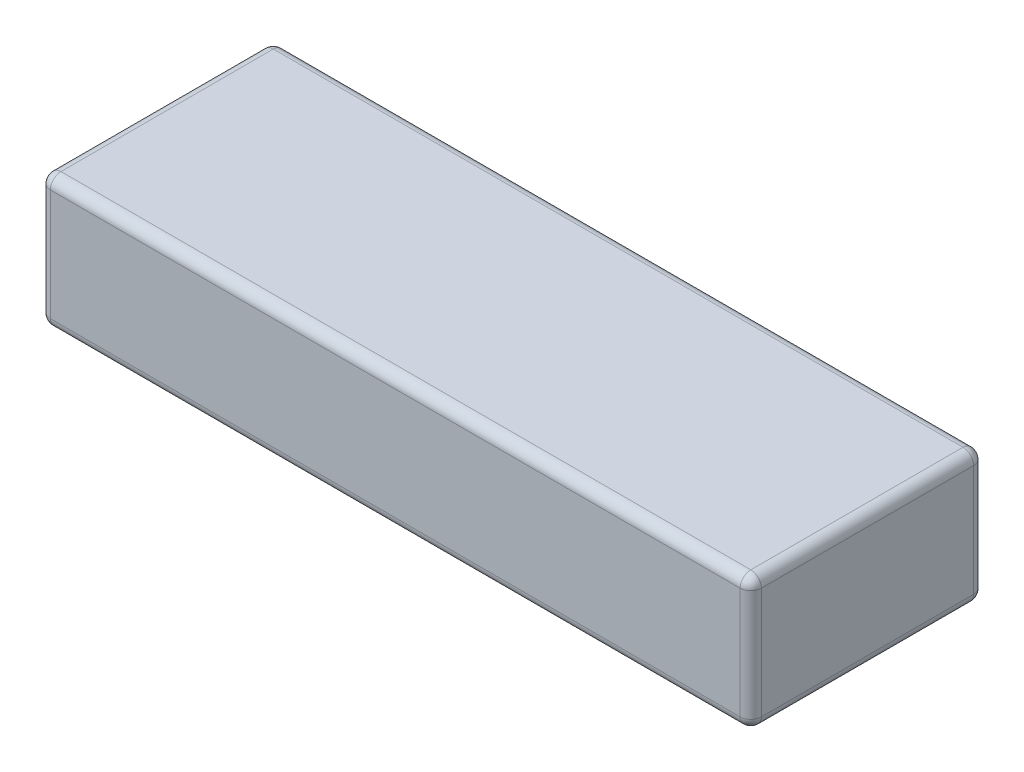
ISO-10303-21;
HEADER;
FILE_DESCRIPTION(('STEP AP214'),'2;1');
FILE_NAME('part.step','',(''),(''),'','','');
FILE_SCHEMA(('AUTOMOTIVE_DESIGN { 1 0 10303 214 1 1 1 1 }'));
ENDSEC;
DATA;
#1=APPLICATION_CONTEXT('core data for automotive mechanical design processes');
#2=APPLICATION_PROTOCOL_DEFINITION('international standard','automotive_design',2000,#1);
#3=PRODUCT_CONTEXT('',#1,'mechanical');
#4=PRODUCT('Part','Part','',(#3));
#5=PRODUCT_RELATED_PRODUCT_CATEGORY('part','',(#4));
#6=PRODUCT_DEFINITION_FORMATION('','',#4);
#7=PRODUCT_DEFINITION_CONTEXT('part definition',#1,'design');
#8=PRODUCT_DEFINITION('design','',#6,#7);
#9=PRODUCT_DEFINITION_SHAPE('','',#8);
#10=(LENGTH_UNIT() NAMED_UNIT(*) SI_UNIT(.MILLI.,.METRE.));
#11=(NAMED_UNIT(*) PLANE_ANGLE_UNIT() SI_UNIT($,.RADIAN.));
#12=(NAMED_UNIT(*) SI_UNIT($,.STERADIAN.) SOLID_ANGLE_UNIT());
#13=UNCERTAINTY_MEASURE_WITH_UNIT(LENGTH_MEASURE(1.E-05),#10,'distance_accuracy_value','');
#14=(GEOMETRIC_REPRESENTATION_CONTEXT(3) GLOBAL_UNCERTAINTY_ASSIGNED_CONTEXT((#13)) GLOBAL_UNIT_ASSIGNED_CONTEXT((#10,
#11,#12)) REPRESENTATION_CONTEXT('',''));
#15=CARTESIAN_POINT('',(0.,0.,0.));
#16=DIRECTION('',(0.,0.,1.));
#17=DIRECTION('',(1.,0.,0.));
#18=AXIS2_PLACEMENT_3D('',#15,#16,#17);
#19=CARTESIAN_POINT('',(67.,25.,22.));
#20=DIRECTION('',(-1.,0.,0.));
#21=DIRECTION('',(0.,0.,1.));
#22=AXIS2_PLACEMENT_3D('',#19,#20,#21);
#23=PLANE('',#22);
#24=DIRECTION('',(0.,-1.,0.));
#25=VECTOR('',#24,1.);
#26=CARTESIAN_POINT('',(67.,25.,-20.));
#27=LINE('',#26,#25);
#28=CARTESIAN_POINT('',(67.,2.,-20.));
#29=VERTEX_POINT('',#28);
#30=CARTESIAN_POINT('',(67.,23.,-20.));
#31=VERTEX_POINT('',#30);
#32=EDGE_CURVE('E128',#29,#31,#27,.F.);
#33=ORIENTED_EDGE('',*,*,#32,.T.);
#34=DIRECTION('',(0.,0.,-1.));
#35=VECTOR('',#34,1.);
#36=CARTESIAN_POINT('',(67.,23.,22.));
#37=LINE('',#36,#35);
#38=CARTESIAN_POINT('',(67.,23.,20.));
#39=VERTEX_POINT('',#38);
#40=EDGE_CURVE('E165',#31,#39,#37,.F.);
#41=ORIENTED_EDGE('',*,*,#40,.T.);
#42=DIRECTION('',(0.,-1.,0.));
#43=VECTOR('',#42,1.);
#44=CARTESIAN_POINT('',(67.,25.,20.));
#45=LINE('',#44,#43);
#46=CARTESIAN_POINT('',(67.,2.,20.));
#47=VERTEX_POINT('',#46);
#48=EDGE_CURVE('E162',#39,#47,#45,.T.);
#49=ORIENTED_EDGE('',*,*,#48,.T.);
#50=DIRECTION('',(0.,0.,-1.));
#51=VECTOR('',#50,1.);
#52=CARTESIAN_POINT('',(67.,2.,-22.));
#53=LINE('',#52,#51);
#54=EDGE_CURVE('E157',#47,#29,#53,.T.);
#55=ORIENTED_EDGE('',*,*,#54,.T.);
#56=EDGE_LOOP('',(#33,#41,#49,#55));
#57=FACE_BOUND('',#56,.T.);
#58=ADVANCED_FACE('F33',(#57),#23,.F.);
#59=CARTESIAN_POINT('',(-67.,25.,-22.));
#60=DIRECTION('',(0.,0.,1.));
#61=DIRECTION('',(1.,0.,0.));
#62=AXIS2_PLACEMENT_3D('',#59,#60,#61);
#63=PLANE('',#62);
#64=DIRECTION('',(0.,-1.,0.));
#65=VECTOR('',#64,1.);
#66=CARTESIAN_POINT('',(-65.,25.,-22.));
#67=LINE('',#66,#65);
#68=CARTESIAN_POINT('',(-65.,2.,-22.));
#69=VERTEX_POINT('',#68);
#70=CARTESIAN_POINT('',(-65.,23.,-22.));
#71=VERTEX_POINT('',#70);
#72=EDGE_CURVE('E150',#69,#71,#67,.F.);
#73=ORIENTED_EDGE('',*,*,#72,.T.);
#74=DIRECTION('',(-1.,0.,0.));
#75=VECTOR('',#74,1.);
#76=CARTESIAN_POINT('',(-67.,23.,-22.));
#77=LINE('',#76,#75);
#78=CARTESIAN_POINT('',(65.,23.,-22.));
#79=VERTEX_POINT('',#78);
#80=EDGE_CURVE('E154',#71,#79,#77,.F.);
#81=ORIENTED_EDGE('',*,*,#80,.T.);
#82=DIRECTION('',(0.,-1.,0.));
#83=VECTOR('',#82,1.);
#84=CARTESIAN_POINT('',(65.,25.,-22.));
#85=LINE('',#84,#83);
#86=CARTESIAN_POINT('',(65.,2.,-22.));
#87=VERTEX_POINT('',#86);
#88=EDGE_CURVE('E126',#79,#87,#85,.T.);
#89=ORIENTED_EDGE('',*,*,#88,.T.);
#90=DIRECTION('',(-1.,0.,0.));
#91=VECTOR('',#90,1.);
#92=CARTESIAN_POINT('',(-67.,2.,-22.));
#93=LINE('',#92,#91);
#94=EDGE_CURVE('E144',#87,#69,#93,.T.);
#95=ORIENTED_EDGE('',*,*,#94,.T.);
#96=EDGE_LOOP('',(#73,#81,#89,#95));
#97=FACE_BOUND('',#96,.T.);
#98=ADVANCED_FACE('F152',(#97),#63,.F.);
#99=CARTESIAN_POINT('',(-67.,25.,22.));
#100=DIRECTION('',(1.,0.,0.));
#101=DIRECTION('',(0.,0.,-1.));
#102=AXIS2_PLACEMENT_3D('',#99,#100,#101);
#103=PLANE('',#102);
#104=DIRECTION('',(0.,-1.,0.));
#105=VECTOR('',#104,1.);
#106=CARTESIAN_POINT('',(-67.,25.,20.));
#107=LINE('',#106,#105);
#108=CARTESIAN_POINT('',(-67.,2.,20.));
#109=VERTEX_POINT('',#108);
#110=CARTESIAN_POINT('',(-67.,23.,20.));
#111=VERTEX_POINT('',#110);
#112=EDGE_CURVE('E169',#109,#111,#107,.F.);
#113=ORIENTED_EDGE('',*,*,#112,.T.);
#114=DIRECTION('',(0.,0.,1.));
#115=VECTOR('',#114,1.);
#116=CARTESIAN_POINT('',(-67.,23.,22.));
#117=LINE('',#116,#115);
#118=CARTESIAN_POINT('',(-67.,23.,-20.));
#119=VERTEX_POINT('',#118);
#120=EDGE_CURVE('E174',#111,#119,#117,.F.);
#121=ORIENTED_EDGE('',*,*,#120,.T.);
#122=DIRECTION('',(0.,-1.,0.));
#123=VECTOR('',#122,1.);
#124=CARTESIAN_POINT('',(-67.,25.,-20.));
#125=LINE('',#124,#123);
#126=CARTESIAN_POINT('',(-67.,2.,-20.));
#127=VERTEX_POINT('',#126);
#128=EDGE_CURVE('E171',#119,#127,#125,.T.);
#129=ORIENTED_EDGE('',*,*,#128,.T.);
#130=DIRECTION('',(0.,0.,1.));
#131=VECTOR('',#130,1.);
#132=CARTESIAN_POINT('',(-67.,2.,22.));
#133=LINE('',#132,#131);
#134=EDGE_CURVE('E167',#127,#109,#133,.T.);
#135=ORIENTED_EDGE('',*,*,#134,.T.);
#136=EDGE_LOOP('',(#113,#121,#129,#135));
#137=FACE_BOUND('',#136,.T.);
#138=ADVANCED_FACE('F279',(#137),#103,.F.);
#139=CARTESIAN_POINT('',(-67.,25.,22.));
#140=DIRECTION('',(0.,0.,-1.));
#141=DIRECTION('',(-1.,0.,0.));
#142=AXIS2_PLACEMENT_3D('',#139,#140,#141);
#143=PLANE('',#142);
#144=DIRECTION('',(0.,-1.,0.));
#145=VECTOR('',#144,1.);
#146=CARTESIAN_POINT('',(65.,25.,22.));
#147=LINE('',#146,#145);
#148=CARTESIAN_POINT('',(65.,2.,22.));
#149=VERTEX_POINT('',#148);
#150=CARTESIAN_POINT('',(65.,23.,22.));
#151=VERTEX_POINT('',#150);
#152=EDGE_CURVE('E178',#149,#151,#147,.F.);
#153=ORIENTED_EDGE('',*,*,#152,.T.);
#154=DIRECTION('',(1.,0.,0.));
#155=VECTOR('',#154,1.);
#156=CARTESIAN_POINT('',(-67.,23.,22.));
#157=LINE('',#156,#155);
#158=CARTESIAN_POINT('',(-65.,23.,22.));
#159=VERTEX_POINT('',#158);
#160=EDGE_CURVE('E183',#151,#159,#157,.F.);
#161=ORIENTED_EDGE('',*,*,#160,.T.);
#162=DIRECTION('',(0.,-1.,0.));
#163=VECTOR('',#162,1.);
#164=CARTESIAN_POINT('',(-65.,25.,22.));
#165=LINE('',#164,#163);
#166=CARTESIAN_POINT('',(-65.,2.,22.));
#167=VERTEX_POINT('',#166);
#168=EDGE_CURVE('E180',#159,#167,#165,.T.);
#169=ORIENTED_EDGE('',*,*,#168,.T.);
#170=DIRECTION('',(1.,0.,0.));
#171=VECTOR('',#170,1.);
#172=CARTESIAN_POINT('',(67.,2.,22.));
#173=LINE('',#172,#171);
#174=EDGE_CURVE('E176',#167,#149,#173,.T.);
#175=ORIENTED_EDGE('',*,*,#174,.T.);
#176=EDGE_LOOP('',(#153,#161,#169,#175));
#177=FACE_BOUND('',#176,.T.);
#178=ADVANCED_FACE('F289',(#177),#143,.F.);
#179=CARTESIAN_POINT('',(0.,25.,0.));
#180=DIRECTION('',(0.,-1.,0.));
#181=DIRECTION('',(0.,0.,-1.));
#182=AXIS2_PLACEMENT_3D('',#179,#180,#181);
#183=PLANE('',#182);
#184=DIRECTION('',(0.,0.,1.));
#185=VECTOR('',#184,1.);
#186=CARTESIAN_POINT('',(-65.,25.,0.));
#187=LINE('',#186,#185);
#188=CARTESIAN_POINT('',(-65.,25.,-20.));
#189=VERTEX_POINT('',#188);
#190=CARTESIAN_POINT('',(-65.,25.,20.));
#191=VERTEX_POINT('',#190);
#192=EDGE_CURVE('E189',#189,#191,#187,.T.);
#193=ORIENTED_EDGE('',*,*,#192,.T.);
#194=DIRECTION('',(1.,0.,0.));
#195=VECTOR('',#194,1.);
#196=CARTESIAN_POINT('',(0.,25.,20.));
#197=LINE('',#196,#195);
#198=CARTESIAN_POINT('',(65.,25.,20.));
#199=VERTEX_POINT('',#198);
#200=EDGE_CURVE('E191',#191,#199,#197,.T.);
#201=ORIENTED_EDGE('',*,*,#200,.T.);
#202=DIRECTION('',(0.,0.,-1.));
#203=VECTOR('',#202,1.);
#204=CARTESIAN_POINT('',(65.,25.,0.));
#205=LINE('',#204,#203);
#206=CARTESIAN_POINT('',(65.,25.,-20.));
#207=VERTEX_POINT('',#206);
#208=EDGE_CURVE('E185',#199,#207,#205,.T.);
#209=ORIENTED_EDGE('',*,*,#208,.T.);
#210=DIRECTION('',(-1.,0.,0.));
#211=VECTOR('',#210,1.);
#212=CARTESIAN_POINT('',(0.,25.,-20.));
#213=LINE('',#212,#211);
#214=EDGE_CURVE('E187',#207,#189,#213,.T.);
#215=ORIENTED_EDGE('',*,*,#214,.T.);
#216=EDGE_LOOP('',(#193,#201,#209,#215));
#217=FACE_BOUND('',#216,.T.);
#218=ADVANCED_FACE('F271',(#217),#183,.F.);
#219=CARTESIAN_POINT('',(0.,0.,0.));
#220=DIRECTION('',(0.,-1.,0.));
#221=DIRECTION('',(0.,0.,-1.));
#222=AXIS2_PLACEMENT_3D('',#219,#220,#221);
#223=PLANE('',#222);
#224=DIRECTION('',(0.,0.,-1.));
#225=VECTOR('',#224,1.);
#226=CARTESIAN_POINT('',(65.,0.,22.));
#227=LINE('',#226,#225);
#228=CARTESIAN_POINT('',(65.,0.,-20.));
#229=VERTEX_POINT('',#228);
#230=CARTESIAN_POINT('',(65.,0.,20.));
#231=VERTEX_POINT('',#230);
#232=EDGE_CURVE('E194',#229,#231,#227,.F.);
#233=ORIENTED_EDGE('',*,*,#232,.T.);
#234=DIRECTION('',(1.,0.,0.));
#235=VECTOR('',#234,1.);
#236=CARTESIAN_POINT('',(-67.,0.,20.));
#237=LINE('',#236,#235);
#238=CARTESIAN_POINT('',(-65.,0.,20.));
#239=VERTEX_POINT('',#238);
#240=EDGE_CURVE('E11',#231,#239,#237,.F.);
#241=ORIENTED_EDGE('',*,*,#240,.T.);
#242=DIRECTION('',(0.,0.,1.));
#243=VECTOR('',#242,1.);
#244=CARTESIAN_POINT('',(-65.,0.,-22.));
#245=LINE('',#244,#243);
#246=CARTESIAN_POINT('',(-65.,0.,-20.));
#247=VERTEX_POINT('',#246);
#248=EDGE_CURVE('E42',#239,#247,#245,.F.);
#249=ORIENTED_EDGE('',*,*,#248,.T.);
#250=DIRECTION('',(-1.,0.,0.));
#251=VECTOR('',#250,1.);
#252=CARTESIAN_POINT('',(67.,0.,-20.));
#253=LINE('',#252,#251);
#254=EDGE_CURVE('E196',#247,#229,#253,.F.);
#255=ORIENTED_EDGE('',*,*,#254,.T.);
#256=EDGE_LOOP('',(#233,#241,#249,#255));
#257=FACE_BOUND('',#256,.T.);
#258=ADVANCED_FACE('F478',(#257),#223,.T.);
#259=CARTESIAN_POINT('',(-65.,25.,20.));
#260=DIRECTION('',(0.,-1.,0.));
#261=DIRECTION('',(0.,0.,-1.));
#262=AXIS2_PLACEMENT_3D('',#259,#260,#261);
#263=CYLINDRICAL_SURFACE('',#262,2.);
#264=CARTESIAN_POINT('',(-65.,23.,20.));
#265=DIRECTION('',(0.,1.,0.));
#266=DIRECTION('',(0.,0.,1.));
#267=AXIS2_PLACEMENT_3D('',#264,#265,#266);
#268=CIRCLE('',#267,2.);
#269=EDGE_CURVE('E37',#111,#159,#268,.T.);
#270=ORIENTED_EDGE('',*,*,#269,.F.);
#271=ORIENTED_EDGE('',*,*,#112,.F.);
#272=CARTESIAN_POINT('',(-65.,2.,20.));
#273=DIRECTION('',(0.,-1.,0.));
#274=DIRECTION('',(0.,0.,-1.));
#275=AXIS2_PLACEMENT_3D('',#272,#273,#274);
#276=CIRCLE('',#275,2.);
#277=EDGE_CURVE('E249',#167,#109,#276,.T.);
#278=ORIENTED_EDGE('',*,*,#277,.F.);
#279=ORIENTED_EDGE('',*,*,#168,.F.);
#280=EDGE_LOOP('',(#270,#271,#278,#279));
#281=FACE_BOUND('',#280,.T.);
#282=ADVANCED_FACE('F35',(#281),#263,.T.);
#283=CARTESIAN_POINT('',(-65.,23.,20.));
#284=DIRECTION('',(0.,0.,1.));
#285=DIRECTION('',(1.,0.,0.));
#286=AXIS2_PLACEMENT_3D('',#283,#284,#285);
#287=SPHERICAL_SURFACE('',#286,2.);
#288=CARTESIAN_POINT('',(-65.,23.,20.));
#289=DIRECTION('',(0.,0.,1.));
#290=DIRECTION('',(1.,0.,0.));
#291=AXIS2_PLACEMENT_3D('',#288,#289,#290);
#292=CIRCLE('',#291,2.);
#293=EDGE_CURVE('E244',#111,#191,#292,.F.);
#294=ORIENTED_EDGE('',*,*,#293,.F.);
#295=ORIENTED_EDGE('',*,*,#269,.T.);
#296=CARTESIAN_POINT('',(-65.,23.,20.));
#297=DIRECTION('',(-1.,0.,0.));
#298=DIRECTION('',(0.,0.,1.));
#299=AXIS2_PLACEMENT_3D('',#296,#297,#298);
#300=CIRCLE('',#299,2.);
#301=EDGE_CURVE('E247',#191,#159,#300,.F.);
#302=ORIENTED_EDGE('',*,*,#301,.F.);
#303=EDGE_LOOP('',(#294,#295,#302));
#304=FACE_BOUND('',#303,.T.);
#305=ADVANCED_FACE('F259',(#304),#287,.T.);
#306=CARTESIAN_POINT('',(-65.,2.,20.));
#307=DIRECTION('',(0.,0.,1.));
#308=DIRECTION('',(1.,0.,0.));
#309=AXIS2_PLACEMENT_3D('',#306,#307,#308);
#310=SPHERICAL_SURFACE('',#309,2.);
#311=CARTESIAN_POINT('',(-65.,2.,20.));
#312=DIRECTION('',(-1.,0.,0.));
#313=DIRECTION('',(0.,0.,1.));
#314=AXIS2_PLACEMENT_3D('',#311,#312,#313);
#315=CIRCLE('',#314,2.);
#316=EDGE_CURVE('E239',#167,#239,#315,.F.);
#317=ORIENTED_EDGE('',*,*,#316,.F.);
#318=ORIENTED_EDGE('',*,*,#277,.T.);
#319=CARTESIAN_POINT('',(-65.,2.,20.));
#320=DIRECTION('',(0.,0.,1.));
#321=DIRECTION('',(1.,0.,0.));
#322=AXIS2_PLACEMENT_3D('',#319,#320,#321);
#323=CIRCLE('',#322,2.);
#324=EDGE_CURVE('E242',#239,#109,#323,.F.);
#325=ORIENTED_EDGE('',*,*,#324,.F.);
#326=EDGE_LOOP('',(#317,#318,#325));
#327=FACE_BOUND('',#326,.T.);
#328=ADVANCED_FACE('F457',(#327),#310,.T.);
#329=CARTESIAN_POINT('',(0.,23.,20.));
#330=DIRECTION('',(1.,0.,0.));
#331=DIRECTION('',(0.,0.,-1.));
#332=AXIS2_PLACEMENT_3D('',#329,#330,#331);
#333=CYLINDRICAL_SURFACE('',#332,2.);
#334=ORIENTED_EDGE('',*,*,#301,.T.);
#335=ORIENTED_EDGE('',*,*,#160,.F.);
#336=CARTESIAN_POINT('',(65.,23.,20.));
#337=DIRECTION('',(1.,0.,0.));
#338=DIRECTION('',(0.,0.,-1.));
#339=AXIS2_PLACEMENT_3D('',#336,#337,#338);
#340=CIRCLE('',#339,2.);
#341=EDGE_CURVE('E233',#199,#151,#340,.T.);
#342=ORIENTED_EDGE('',*,*,#341,.F.);
#343=ORIENTED_EDGE('',*,*,#200,.F.);
#344=EDGE_LOOP('',(#334,#335,#342,#343));
#345=FACE_BOUND('',#344,.T.);
#346=ADVANCED_FACE('F267',(#345),#333,.T.);
#347=CARTESIAN_POINT('',(-65.,23.,0.));
#348=DIRECTION('',(0.,0.,1.));
#349=DIRECTION('',(1.,0.,0.));
#350=AXIS2_PLACEMENT_3D('',#347,#348,#349);
#351=CYLINDRICAL_SURFACE('',#350,2.);
#352=ORIENTED_EDGE('',*,*,#293,.T.);
#353=ORIENTED_EDGE('',*,*,#192,.F.);
#354=CARTESIAN_POINT('',(-65.,23.,-20.));
#355=DIRECTION('',(0.,0.,-1.));
#356=DIRECTION('',(-1.,0.,0.));
#357=AXIS2_PLACEMENT_3D('',#354,#355,#356);
#358=CIRCLE('',#357,2.);
#359=EDGE_CURVE('E230',#119,#189,#358,.T.);
#360=ORIENTED_EDGE('',*,*,#359,.F.);
#361=ORIENTED_EDGE('',*,*,#120,.F.);
#362=EDGE_LOOP('',(#352,#353,#360,#361));
#363=FACE_BOUND('',#362,.T.);
#364=ADVANCED_FACE('F276',(#363),#351,.T.);
#365=CARTESIAN_POINT('',(-65.,25.,-20.));
#366=DIRECTION('',(0.,-1.,0.));
#367=DIRECTION('',(0.,0.,-1.));
#368=AXIS2_PLACEMENT_3D('',#365,#366,#367);
#369=CYLINDRICAL_SURFACE('',#368,2.);
#370=CARTESIAN_POINT('',(-65.,2.,-20.));
#371=DIRECTION('',(0.,-1.,0.));
#372=DIRECTION('',(0.,0.,-1.));
#373=AXIS2_PLACEMENT_3D('',#370,#371,#372);
#374=CIRCLE('',#373,2.);
#375=EDGE_CURVE('E224',#127,#69,#374,.T.);
#376=ORIENTED_EDGE('',*,*,#375,.F.);
#377=ORIENTED_EDGE('',*,*,#128,.F.);
#378=CARTESIAN_POINT('',(-65.,23.,-20.));
#379=DIRECTION('',(0.,1.,0.));
#380=DIRECTION('',(0.,0.,1.));
#381=AXIS2_PLACEMENT_3D('',#378,#379,#380);
#382=CIRCLE('',#381,2.);
#383=EDGE_CURVE('E227',#71,#119,#382,.T.);
#384=ORIENTED_EDGE('',*,*,#383,.F.);
#385=ORIENTED_EDGE('',*,*,#72,.F.);
#386=EDGE_LOOP('',(#376,#377,#384,#385));
#387=FACE_BOUND('',#386,.T.);
#388=ADVANCED_FACE('F283',(#387),#369,.T.);
#389=CARTESIAN_POINT('',(-65.,2.,22.));
#390=DIRECTION('',(0.,0.,-1.));
#391=DIRECTION('',(-1.,0.,0.));
#392=AXIS2_PLACEMENT_3D('',#389,#390,#391);
#393=CYLINDRICAL_SURFACE('',#392,2.);
#394=ORIENTED_EDGE('',*,*,#324,.T.);
#395=ORIENTED_EDGE('',*,*,#134,.F.);
#396=CARTESIAN_POINT('',(-65.,2.,-20.));
#397=DIRECTION('',(0.,0.,-1.));
#398=DIRECTION('',(-1.,0.,0.));
#399=AXIS2_PLACEMENT_3D('',#396,#397,#398);
#400=CIRCLE('',#399,2.);
#401=EDGE_CURVE('E222',#247,#127,#400,.T.);
#402=ORIENTED_EDGE('',*,*,#401,.F.);
#403=ORIENTED_EDGE('',*,*,#248,.F.);
#404=EDGE_LOOP('',(#394,#395,#402,#403));
#405=FACE_BOUND('',#404,.T.);
#406=ADVANCED_FACE('F287',(#405),#393,.T.);
#407=CARTESIAN_POINT('',(-67.,2.,20.));
#408=DIRECTION('',(-1.,0.,0.));
#409=DIRECTION('',(0.,0.,1.));
#410=AXIS2_PLACEMENT_3D('',#407,#408,#409);
#411=CYLINDRICAL_SURFACE('',#410,2.);
#412=ORIENTED_EDGE('',*,*,#316,.T.);
#413=ORIENTED_EDGE('',*,*,#240,.F.);
#414=CARTESIAN_POINT('',(65.,2.,20.));
#415=DIRECTION('',(1.,0.,0.));
#416=DIRECTION('',(0.,0.,-1.));
#417=AXIS2_PLACEMENT_3D('',#414,#415,#416);
#418=CIRCLE('',#417,2.);
#419=EDGE_CURVE('E219',#149,#231,#418,.T.);
#420=ORIENTED_EDGE('',*,*,#419,.F.);
#421=ORIENTED_EDGE('',*,*,#174,.F.);
#422=EDGE_LOOP('',(#412,#413,#420,#421));
#423=FACE_BOUND('',#422,.T.);
#424=ADVANCED_FACE('F299',(#423),#411,.T.);
#425=CARTESIAN_POINT('',(65.,25.,20.));
#426=DIRECTION('',(0.,-1.,0.));
#427=DIRECTION('',(0.,0.,-1.));
#428=AXIS2_PLACEMENT_3D('',#425,#426,#427);
#429=CYLINDRICAL_SURFACE('',#428,2.);
#430=CARTESIAN_POINT('',(65.,23.,20.));
#431=DIRECTION('',(0.,1.,0.));
#432=DIRECTION('',(0.,0.,1.));
#433=AXIS2_PLACEMENT_3D('',#430,#431,#432);
#434=CIRCLE('',#433,2.);
#435=EDGE_CURVE('E236',#151,#39,#434,.T.);
#436=ORIENTED_EDGE('',*,*,#435,.F.);
#437=ORIENTED_EDGE('',*,*,#152,.F.);
#438=CARTESIAN_POINT('',(65.,2.,20.));
#439=DIRECTION('',(0.,-1.,0.));
#440=DIRECTION('',(0.,0.,-1.));
#441=AXIS2_PLACEMENT_3D('',#438,#439,#440);
#442=CIRCLE('',#441,2.);
#443=EDGE_CURVE('E216',#47,#149,#442,.T.);
#444=ORIENTED_EDGE('',*,*,#443,.F.);
#445=ORIENTED_EDGE('',*,*,#48,.F.);
#446=EDGE_LOOP('',(#436,#437,#444,#445));
#447=FACE_BOUND('',#446,.T.);
#448=ADVANCED_FACE('F294',(#447),#429,.T.);
#449=CARTESIAN_POINT('',(65.,23.,20.));
#450=DIRECTION('',(0.,0.,1.));
#451=DIRECTION('',(1.,0.,0.));
#452=AXIS2_PLACEMENT_3D('',#449,#450,#451);
#453=SPHERICAL_SURFACE('',#452,2.);
#454=ORIENTED_EDGE('',*,*,#341,.T.);
#455=ORIENTED_EDGE('',*,*,#435,.T.);
#456=CARTESIAN_POINT('',(65.,23.,20.));
#457=DIRECTION('',(0.,0.,1.));
#458=DIRECTION('',(1.,0.,0.));
#459=AXIS2_PLACEMENT_3D('',#456,#457,#458);
#460=CIRCLE('',#459,2.);
#461=EDGE_CURVE('E213',#199,#39,#460,.F.);
#462=ORIENTED_EDGE('',*,*,#461,.F.);
#463=EDGE_LOOP('',(#454,#455,#462));
#464=FACE_BOUND('',#463,.T.);
#465=ADVANCED_FACE('F310',(#464),#453,.T.);
#466=CARTESIAN_POINT('',(-65.,23.,-20.));
#467=DIRECTION('',(0.,0.,1.));
#468=DIRECTION('',(1.,0.,0.));
#469=AXIS2_PLACEMENT_3D('',#466,#467,#468);
#470=SPHERICAL_SURFACE('',#469,2.);
#471=ORIENTED_EDGE('',*,*,#383,.T.);
#472=ORIENTED_EDGE('',*,*,#359,.T.);
#473=CARTESIAN_POINT('',(-65.,23.,-20.));
#474=DIRECTION('',(-1.,0.,0.));
#475=DIRECTION('',(0.,0.,1.));
#476=AXIS2_PLACEMENT_3D('',#473,#474,#475);
#477=CIRCLE('',#476,2.);
#478=EDGE_CURVE('E210',#71,#189,#477,.F.);
#479=ORIENTED_EDGE('',*,*,#478,.F.);
#480=EDGE_LOOP('',(#471,#472,#479));
#481=FACE_BOUND('',#480,.T.);
#482=ADVANCED_FACE('F320',(#481),#470,.T.);
#483=CARTESIAN_POINT('',(-65.,2.,-20.));
#484=DIRECTION('',(0.,0.,1.));
#485=DIRECTION('',(1.,0.,0.));
#486=AXIS2_PLACEMENT_3D('',#483,#484,#485);
#487=SPHERICAL_SURFACE('',#486,2.);
#488=ORIENTED_EDGE('',*,*,#401,.T.);
#489=ORIENTED_EDGE('',*,*,#375,.T.);
#490=CARTESIAN_POINT('',(-65.,2.,-20.));
#491=DIRECTION('',(-1.,0.,0.));
#492=DIRECTION('',(0.,0.,1.));
#493=AXIS2_PLACEMENT_3D('',#490,#491,#492);
#494=CIRCLE('',#493,2.);
#495=EDGE_CURVE('E147',#247,#69,#494,.F.);
#496=ORIENTED_EDGE('',*,*,#495,.F.);
#497=EDGE_LOOP('',(#488,#489,#496));
#498=FACE_BOUND('',#497,.T.);
#499=ADVANCED_FACE('F322',(#498),#487,.T.);
#500=CARTESIAN_POINT('',(65.,2.,20.));
#501=DIRECTION('',(0.,0.,1.));
#502=DIRECTION('',(1.,0.,0.));
#503=AXIS2_PLACEMENT_3D('',#500,#501,#502);
#504=SPHERICAL_SURFACE('',#503,2.);
#505=ORIENTED_EDGE('',*,*,#443,.T.);
#506=ORIENTED_EDGE('',*,*,#419,.T.);
#507=CARTESIAN_POINT('',(65.,2.,20.));
#508=DIRECTION('',(0.,0.,1.));
#509=DIRECTION('',(1.,0.,0.));
#510=AXIS2_PLACEMENT_3D('',#507,#508,#509);
#511=CIRCLE('',#510,2.);
#512=EDGE_CURVE('E206',#47,#231,#511,.F.);
#513=ORIENTED_EDGE('',*,*,#512,.F.);
#514=EDGE_LOOP('',(#505,#506,#513));
#515=FACE_BOUND('',#514,.T.);
#516=ADVANCED_FACE('F301',(#515),#504,.T.);
#517=CARTESIAN_POINT('',(65.,23.,0.));
#518=DIRECTION('',(0.,0.,-1.));
#519=DIRECTION('',(-1.,0.,0.));
#520=AXIS2_PLACEMENT_3D('',#517,#518,#519);
#521=CYLINDRICAL_SURFACE('',#520,2.);
#522=ORIENTED_EDGE('',*,*,#461,.T.);
#523=ORIENTED_EDGE('',*,*,#40,.F.);
#524=CARTESIAN_POINT('',(65.,23.,-20.));
#525=DIRECTION('',(0.,0.,-1.));
#526=DIRECTION('',(-1.,0.,0.));
#527=AXIS2_PLACEMENT_3D('',#524,#525,#526);
#528=CIRCLE('',#527,2.);
#529=EDGE_CURVE('E203',#207,#31,#528,.T.);
#530=ORIENTED_EDGE('',*,*,#529,.F.);
#531=ORIENTED_EDGE('',*,*,#208,.F.);
#532=EDGE_LOOP('',(#522,#523,#530,#531));
#533=FACE_BOUND('',#532,.T.);
#534=ADVANCED_FACE('F312',(#533),#521,.T.);
#535=CARTESIAN_POINT('',(0.,23.,-20.));
#536=DIRECTION('',(-1.,0.,0.));
#537=DIRECTION('',(0.,0.,1.));
#538=AXIS2_PLACEMENT_3D('',#535,#536,#537);
#539=CYLINDRICAL_SURFACE('',#538,2.);
#540=ORIENTED_EDGE('',*,*,#478,.T.);
#541=ORIENTED_EDGE('',*,*,#214,.F.);
#542=CARTESIAN_POINT('',(65.,23.,-20.));
#543=DIRECTION('',(1.,0.,0.));
#544=DIRECTION('',(0.,0.,-1.));
#545=AXIS2_PLACEMENT_3D('',#542,#543,#544);
#546=CIRCLE('',#545,2.);
#547=EDGE_CURVE('E141',#79,#207,#546,.T.);
#548=ORIENTED_EDGE('',*,*,#547,.F.);
#549=ORIENTED_EDGE('',*,*,#80,.F.);
#550=EDGE_LOOP('',(#540,#541,#548,#549));
#551=FACE_BOUND('',#550,.T.);
#552=ADVANCED_FACE('F318',(#551),#539,.T.);
#553=CARTESIAN_POINT('',(-67.,2.,-20.));
#554=DIRECTION('',(1.,0.,0.));
#555=DIRECTION('',(0.,0.,-1.));
#556=AXIS2_PLACEMENT_3D('',#553,#554,#555);
#557=CYLINDRICAL_SURFACE('',#556,2.);
#558=ORIENTED_EDGE('',*,*,#495,.T.);
#559=ORIENTED_EDGE('',*,*,#94,.F.);
#560=CARTESIAN_POINT('',(65.,2.,-20.));
#561=DIRECTION('',(1.,0.,0.));
#562=DIRECTION('',(0.,0.,-1.));
#563=AXIS2_PLACEMENT_3D('',#560,#561,#562);
#564=CIRCLE('',#563,2.);
#565=EDGE_CURVE('E134',#229,#87,#564,.T.);
#566=ORIENTED_EDGE('',*,*,#565,.F.);
#567=ORIENTED_EDGE('',*,*,#254,.F.);
#568=EDGE_LOOP('',(#558,#559,#566,#567));
#569=FACE_BOUND('',#568,.T.);
#570=ADVANCED_FACE('F145',(#569),#557,.T.);
#571=CARTESIAN_POINT('',(65.,2.,22.));
#572=DIRECTION('',(0.,0.,1.));
#573=DIRECTION('',(1.,0.,0.));
#574=AXIS2_PLACEMENT_3D('',#571,#572,#573);
#575=CYLINDRICAL_SURFACE('',#574,2.);
#576=ORIENTED_EDGE('',*,*,#512,.T.);
#577=ORIENTED_EDGE('',*,*,#232,.F.);
#578=CARTESIAN_POINT('',(65.,2.,-20.));
#579=DIRECTION('',(0.,0.,-1.));
#580=DIRECTION('',(-1.,0.,0.));
#581=AXIS2_PLACEMENT_3D('',#578,#579,#580);
#582=CIRCLE('',#581,2.);
#583=EDGE_CURVE('E138',#29,#229,#582,.T.);
#584=ORIENTED_EDGE('',*,*,#583,.F.);
#585=ORIENTED_EDGE('',*,*,#54,.F.);
#586=EDGE_LOOP('',(#576,#577,#584,#585));
#587=FACE_BOUND('',#586,.T.);
#588=ADVANCED_FACE('F305',(#587),#575,.T.);
#589=CARTESIAN_POINT('',(65.,23.,-20.));
#590=DIRECTION('',(0.,0.,1.));
#591=DIRECTION('',(1.,0.,0.));
#592=AXIS2_PLACEMENT_3D('',#589,#590,#591);
#593=SPHERICAL_SURFACE('',#592,2.);
#594=ORIENTED_EDGE('',*,*,#547,.T.);
#595=ORIENTED_EDGE('',*,*,#529,.T.);
#596=CARTESIAN_POINT('',(65.,23.,-20.));
#597=DIRECTION('',(0.,1.,0.));
#598=DIRECTION('',(0.,0.,1.));
#599=AXIS2_PLACEMENT_3D('',#596,#597,#598);
#600=CIRCLE('',#599,2.);
#601=EDGE_CURVE('E131',#79,#31,#600,.F.);
#602=ORIENTED_EDGE('',*,*,#601,.F.);
#603=EDGE_LOOP('',(#594,#595,#602));
#604=FACE_BOUND('',#603,.T.);
#605=ADVANCED_FACE('F316',(#604),#593,.T.);
#606=CARTESIAN_POINT('',(65.,2.,-20.));
#607=DIRECTION('',(0.,0.,1.));
#608=DIRECTION('',(1.,0.,0.));
#609=AXIS2_PLACEMENT_3D('',#606,#607,#608);
#610=SPHERICAL_SURFACE('',#609,2.);
#611=ORIENTED_EDGE('',*,*,#583,.T.);
#612=ORIENTED_EDGE('',*,*,#565,.T.);
#613=CARTESIAN_POINT('',(65.,2.,-20.));
#614=DIRECTION('',(0.,-1.,0.));
#615=DIRECTION('',(0.,0.,-1.));
#616=AXIS2_PLACEMENT_3D('',#613,#614,#615);
#617=CIRCLE('',#616,2.);
#618=EDGE_CURVE('E122',#29,#87,#617,.F.);
#619=ORIENTED_EDGE('',*,*,#618,.F.);
#620=EDGE_LOOP('',(#611,#612,#619));
#621=FACE_BOUND('',#620,.T.);
#622=ADVANCED_FACE('F136',(#621),#610,.T.);
#623=CARTESIAN_POINT('',(65.,25.,-20.));
#624=DIRECTION('',(0.,-1.,0.));
#625=DIRECTION('',(0.,0.,-1.));
#626=AXIS2_PLACEMENT_3D('',#623,#624,#625);
#627=CYLINDRICAL_SURFACE('',#626,2.);
#628=ORIENTED_EDGE('',*,*,#601,.T.);
#629=ORIENTED_EDGE('',*,*,#32,.F.);
#630=ORIENTED_EDGE('',*,*,#618,.T.);
#631=ORIENTED_EDGE('',*,*,#88,.F.);
#632=EDGE_LOOP('',(#628,#629,#630,#631));
#633=FACE_BOUND('',#632,.T.);
#634=ADVANCED_FACE('F124',(#633),#627,.T.);
#635=CLOSED_SHELL('',(#58,#98,#138,#178,#218,#258,#282,#305,#328,#346,#364,#388,#406,#424,#448,
#465,#482,#499,#516,#534,#552,#570,#588,#605,#622,#634));
#636=MANIFOLD_SOLID_BREP('B2',#635);
#637=ADVANCED_BREP_SHAPE_REPRESENTATION('',(#18,#636),#14);
#638=SHAPE_DEFINITION_REPRESENTATION(#9,#637);
ENDSEC;
END-ISO-10303-21;
